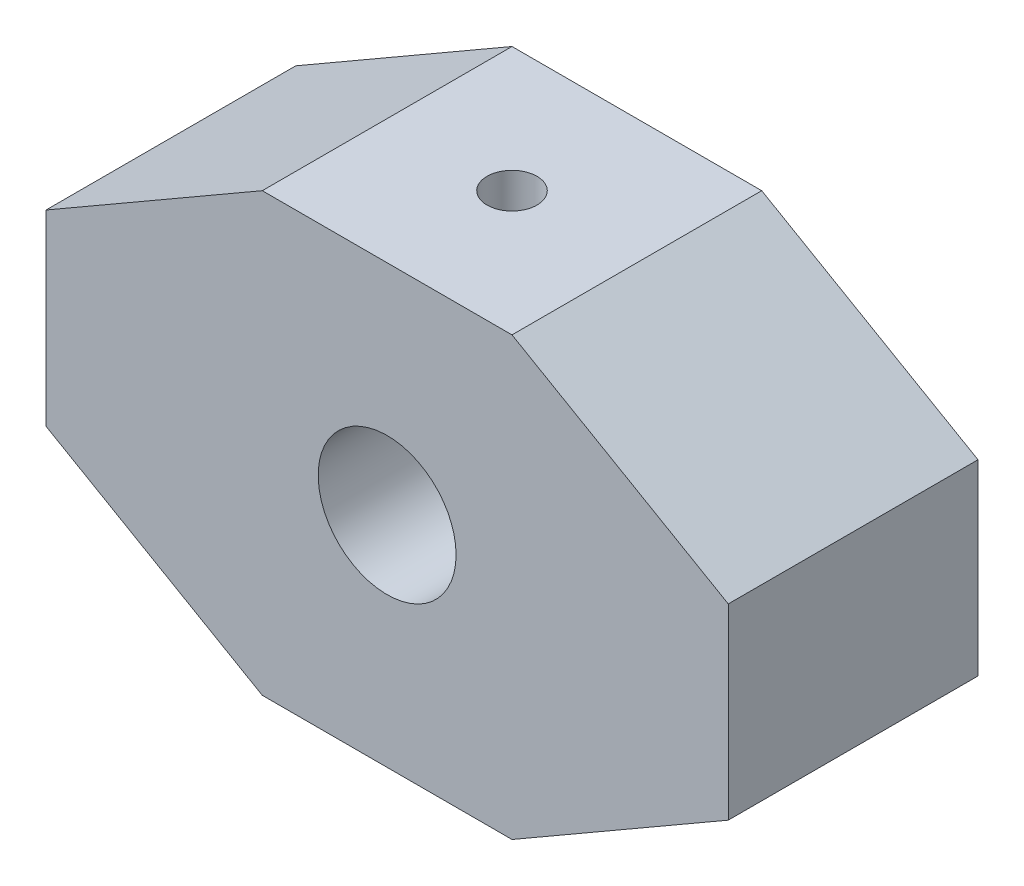
ISO-10303-21;
HEADER;
FILE_DESCRIPTION(('STEP AP214'),'2;1');
FILE_NAME('part.step','',(''),(''),'','','');
FILE_SCHEMA(('AUTOMOTIVE_DESIGN { 1 0 10303 214 1 1 1 1 }'));
ENDSEC;
DATA;
#1=APPLICATION_CONTEXT('core data for automotive mechanical design processes');
#2=APPLICATION_PROTOCOL_DEFINITION('international standard','automotive_design',2000,#1);
#3=PRODUCT_CONTEXT('',#1,'mechanical');
#4=PRODUCT('Part','Part','',(#3));
#5=PRODUCT_RELATED_PRODUCT_CATEGORY('part','',(#4));
#6=PRODUCT_DEFINITION_FORMATION('','',#4);
#7=PRODUCT_DEFINITION_CONTEXT('part definition',#1,'design');
#8=PRODUCT_DEFINITION('design','',#6,#7);
#9=PRODUCT_DEFINITION_SHAPE('','',#8);
#10=(LENGTH_UNIT() NAMED_UNIT(*) SI_UNIT(.MILLI.,.METRE.));
#11=(NAMED_UNIT(*) PLANE_ANGLE_UNIT() SI_UNIT($,.RADIAN.));
#12=(NAMED_UNIT(*) SI_UNIT($,.STERADIAN.) SOLID_ANGLE_UNIT());
#13=UNCERTAINTY_MEASURE_WITH_UNIT(LENGTH_MEASURE(1.E-05),#10,'distance_accuracy_value','');
#14=(GEOMETRIC_REPRESENTATION_CONTEXT(3) GLOBAL_UNCERTAINTY_ASSIGNED_CONTEXT((#13)) GLOBAL_UNIT_ASSIGNED_CONTEXT((#10,
#11,#12)) REPRESENTATION_CONTEXT('',''));
#15=CARTESIAN_POINT('',(0.,0.,0.));
#16=DIRECTION('',(0.,0.,1.));
#17=DIRECTION('',(1.,0.,0.));
#18=AXIS2_PLACEMENT_3D('',#15,#16,#17);
#19=CARTESIAN_POINT('',(1.6363883111979,1.79816513761468,2.));
#20=DIRECTION('',(0.,-1.,0.));
#21=DIRECTION('',(1.,0.,0.));
#22=AXIS2_PLACEMENT_3D('',#19,#20,#21);
#23=PLANE('',#22);
#24=CARTESIAN_POINT('',(0.636398311197897,1.79816513761468,0.99999));
#25=DIRECTION('',(0.,1.,0.));
#26=DIRECTION('',(-1.,0.,0.));
#27=AXIS2_PLACEMENT_3D('',#24,#25,#26);
#28=CIRCLE('',#27,0.2);
#29=CARTESIAN_POINT('',(0.436398311197897,1.79816513761468,0.99999));
#30=VERTEX_POINT('',#29);
#31=EDGE_CURVE('E188',#30,#30,#28,.T.);
#32=ORIENTED_EDGE('',*,*,#31,.F.);
#33=EDGE_LOOP('',(#32));
#34=FACE_BOUND('',#33,.T.);
#35=DIRECTION('',(-1.,0.,0.));
#36=VECTOR('',#35,1.);
#37=CARTESIAN_POINT('',(1.6363883111979,1.79816513761468,0.));
#38=LINE('',#37,#36);
#39=CARTESIAN_POINT('',(1.6363883111979,1.79816513761468,0.));
#40=VERTEX_POINT('',#39);
#41=CARTESIAN_POINT('',(-0.363611688802103,1.79816513761468,0.));
#42=VERTEX_POINT('',#41);
#43=EDGE_CURVE('E134',#40,#42,#38,.T.);
#44=ORIENTED_EDGE('',*,*,#43,.T.);
#45=DIRECTION('',(0.,0.,-1.));
#46=VECTOR('',#45,1.);
#47=CARTESIAN_POINT('',(-0.363611688802103,1.79816513761468,2.));
#48=LINE('',#47,#46);
#49=CARTESIAN_POINT('',(-0.363611688802103,1.79816513761468,2.));
#50=VERTEX_POINT('',#49);
#51=EDGE_CURVE('E11',#50,#42,#48,.T.);
#52=ORIENTED_EDGE('',*,*,#51,.F.);
#53=DIRECTION('',(-1.,0.,0.));
#54=VECTOR('',#53,1.);
#55=CARTESIAN_POINT('',(1.6363883111979,1.79816513761468,2.));
#56=LINE('',#55,#54);
#57=CARTESIAN_POINT('',(1.6363883111979,1.79816513761468,2.));
#58=VERTEX_POINT('',#57);
#59=EDGE_CURVE('E149',#58,#50,#56,.T.);
#60=ORIENTED_EDGE('',*,*,#59,.F.);
#61=DIRECTION('',(0.,0.,-1.));
#62=VECTOR('',#61,1.);
#63=CARTESIAN_POINT('',(1.6363883111979,1.79816513761468,2.));
#64=LINE('',#63,#62);
#65=EDGE_CURVE('E130',#58,#40,#64,.T.);
#66=ORIENTED_EDGE('',*,*,#65,.T.);
#67=EDGE_LOOP('',(#44,#52,#60,#66));
#68=FACE_BOUND('',#67,.T.);
#69=ADVANCED_FACE('F33',(#34,#68),#23,.F.);
#70=CARTESIAN_POINT('',(-0.363611688802103,1.79816513761468,2.));
#71=DIRECTION('',(0.5,-0.866025403784438,0.));
#72=DIRECTION('',(0.866025403784439,0.5,0.));
#73=AXIS2_PLACEMENT_3D('',#70,#71,#72);
#74=PLANE('',#73);
#75=DIRECTION('',(-0.866025403784438,-0.5,0.));
#76=VECTOR('',#75,1.);
#77=CARTESIAN_POINT('',(-0.363611688802103,1.79816513761468,0.));
#78=LINE('',#77,#76);
#79=CARTESIAN_POINT('',(-2.09566249637098,0.798165137614678,0.));
#80=VERTEX_POINT('',#79);
#81=EDGE_CURVE('E137',#42,#80,#78,.T.);
#82=ORIENTED_EDGE('',*,*,#81,.T.);
#83=DIRECTION('',(0.,0.,-1.));
#84=VECTOR('',#83,1.);
#85=CARTESIAN_POINT('',(-2.09566249637098,0.798165137614678,2.));
#86=LINE('',#85,#84);
#87=CARTESIAN_POINT('',(-2.09566249637098,0.798165137614678,2.));
#88=VERTEX_POINT('',#87);
#89=EDGE_CURVE('E46',#88,#80,#86,.T.);
#90=ORIENTED_EDGE('',*,*,#89,.F.);
#91=DIRECTION('',(-0.866025403784438,-0.5,0.));
#92=VECTOR('',#91,1.);
#93=CARTESIAN_POINT('',(-0.363611688802103,1.79816513761468,2.));
#94=LINE('',#93,#92);
#95=EDGE_CURVE('E97',#50,#88,#94,.T.);
#96=ORIENTED_EDGE('',*,*,#95,.F.);
#97=ORIENTED_EDGE('',*,*,#51,.T.);
#98=EDGE_LOOP('',(#82,#90,#96,#97));
#99=FACE_BOUND('',#98,.T.);
#100=ADVANCED_FACE('F205',(#99),#74,.F.);
#101=CARTESIAN_POINT('',(-2.09566249637098,0.798165137614678,2.));
#102=DIRECTION('',(1.,0.,0.));
#103=DIRECTION('',(0.,0.,-1.));
#104=AXIS2_PLACEMENT_3D('',#101,#102,#103);
#105=PLANE('',#104);
#106=DIRECTION('',(0.,-1.,0.));
#107=VECTOR('',#106,1.);
#108=CARTESIAN_POINT('',(-2.09566249637098,0.798165137614678,0.));
#109=LINE('',#108,#107);
#110=CARTESIAN_POINT('',(-2.09566249637098,-0.701834862385322,0.));
#111=VERTEX_POINT('',#110);
#112=EDGE_CURVE('E140',#80,#111,#109,.T.);
#113=ORIENTED_EDGE('',*,*,#112,.T.);
#114=DIRECTION('',(0.,0.,-1.));
#115=VECTOR('',#114,1.);
#116=CARTESIAN_POINT('',(-2.09566249637098,-0.701834862385322,2.));
#117=LINE('',#116,#115);
#118=CARTESIAN_POINT('',(-2.09566249637098,-0.701834862385322,2.));
#119=VERTEX_POINT('',#118);
#120=EDGE_CURVE('E156',#119,#111,#117,.T.);
#121=ORIENTED_EDGE('',*,*,#120,.F.);
#122=DIRECTION('',(0.,-1.,0.));
#123=VECTOR('',#122,1.);
#124=CARTESIAN_POINT('',(-2.09566249637098,0.798165137614678,2.));
#125=LINE('',#124,#123);
#126=EDGE_CURVE('E165',#88,#119,#125,.T.);
#127=ORIENTED_EDGE('',*,*,#126,.F.);
#128=ORIENTED_EDGE('',*,*,#89,.T.);
#129=EDGE_LOOP('',(#113,#121,#127,#128));
#130=FACE_BOUND('',#129,.T.);
#131=ADVANCED_FACE('F163',(#130),#105,.F.);
#132=CARTESIAN_POINT('',(-2.09566249637098,-0.701834862385322,2.));
#133=DIRECTION('',(0.5,0.866025403784439,0.));
#134=DIRECTION('',(-0.866025403784439,0.5,0.));
#135=AXIS2_PLACEMENT_3D('',#132,#133,#134);
#136=PLANE('',#135);
#137=DIRECTION('',(0.866025403784439,-0.5,0.));
#138=VECTOR('',#137,1.);
#139=CARTESIAN_POINT('',(-2.09566249637098,-0.701834862385322,0.));
#140=LINE('',#139,#138);
#141=CARTESIAN_POINT('',(-0.363611688802103,-1.70183486238532,0.));
#142=VERTEX_POINT('',#141);
#143=EDGE_CURVE('E142',#111,#142,#140,.T.);
#144=ORIENTED_EDGE('',*,*,#143,.T.);
#145=DIRECTION('',(0.,0.,-1.));
#146=VECTOR('',#145,1.);
#147=CARTESIAN_POINT('',(-0.363611688802103,-1.70183486238532,2.));
#148=LINE('',#147,#146);
#149=CARTESIAN_POINT('',(-0.363611688802103,-1.70183486238532,2.));
#150=VERTEX_POINT('',#149);
#151=EDGE_CURVE('E153',#150,#142,#148,.T.);
#152=ORIENTED_EDGE('',*,*,#151,.F.);
#153=DIRECTION('',(0.866025403784439,-0.5,0.));
#154=VECTOR('',#153,1.);
#155=CARTESIAN_POINT('',(-2.09566249637098,-0.701834862385322,2.));
#156=LINE('',#155,#154);
#157=EDGE_CURVE('E177',#119,#150,#156,.T.);
#158=ORIENTED_EDGE('',*,*,#157,.F.);
#159=ORIENTED_EDGE('',*,*,#120,.T.);
#160=EDGE_LOOP('',(#144,#152,#158,#159));
#161=FACE_BOUND('',#160,.T.);
#162=ADVANCED_FACE('F173',(#161),#136,.F.);
#163=CARTESIAN_POINT('',(-0.363611688802103,-1.70183486238532,2.));
#164=DIRECTION('',(0.,1.,0.));
#165=DIRECTION('',(-1.,0.,0.));
#166=AXIS2_PLACEMENT_3D('',#163,#164,#165);
#167=PLANE('',#166);
#168=DIRECTION('',(1.,0.,0.));
#169=VECTOR('',#168,1.);
#170=CARTESIAN_POINT('',(-0.363611688802103,-1.70183486238532,0.));
#171=LINE('',#170,#169);
#172=CARTESIAN_POINT('',(1.6363883111979,-1.70183486238532,0.));
#173=VERTEX_POINT('',#172);
#174=EDGE_CURVE('E144',#142,#173,#171,.T.);
#175=ORIENTED_EDGE('',*,*,#174,.T.);
#176=DIRECTION('',(0.,0.,-1.));
#177=VECTOR('',#176,1.);
#178=CARTESIAN_POINT('',(1.6363883111979,-1.70183486238532,2.));
#179=LINE('',#178,#177);
#180=CARTESIAN_POINT('',(1.6363883111979,-1.70183486238532,2.));
#181=VERTEX_POINT('',#180);
#182=EDGE_CURVE('E125',#181,#173,#179,.T.);
#183=ORIENTED_EDGE('',*,*,#182,.F.);
#184=DIRECTION('',(1.,0.,0.));
#185=VECTOR('',#184,1.);
#186=CARTESIAN_POINT('',(-0.363611688802103,-1.70183486238532,2.));
#187=LINE('',#186,#185);
#188=EDGE_CURVE('E116',#150,#181,#187,.T.);
#189=ORIENTED_EDGE('',*,*,#188,.F.);
#190=ORIENTED_EDGE('',*,*,#151,.T.);
#191=EDGE_LOOP('',(#175,#183,#189,#190));
#192=FACE_BOUND('',#191,.T.);
#193=ADVANCED_FACE('F176',(#192),#167,.F.);
#194=CARTESIAN_POINT('',(1.6363883111979,-1.70183486238532,2.));
#195=DIRECTION('',(-0.5,0.866025403784439,0.));
#196=DIRECTION('',(-0.866025403784439,-0.5,0.));
#197=AXIS2_PLACEMENT_3D('',#194,#195,#196);
#198=PLANE('',#197);
#199=DIRECTION('',(0.866025403784439,0.5,0.));
#200=VECTOR('',#199,1.);
#201=CARTESIAN_POINT('',(1.6363883111979,-1.70183486238532,0.));
#202=LINE('',#201,#200);
#203=CARTESIAN_POINT('',(3.36843911876677,-0.701834862385322,0.));
#204=VERTEX_POINT('',#203);
#205=EDGE_CURVE('E124',#173,#204,#202,.T.);
#206=ORIENTED_EDGE('',*,*,#205,.T.);
#207=DIRECTION('',(0.,0.,-1.));
#208=VECTOR('',#207,1.);
#209=CARTESIAN_POINT('',(3.36843911876677,-0.701834862385322,2.));
#210=LINE('',#209,#208);
#211=CARTESIAN_POINT('',(3.36843911876677,-0.701834862385322,2.));
#212=VERTEX_POINT('',#211);
#213=EDGE_CURVE('E121',#212,#204,#210,.T.);
#214=ORIENTED_EDGE('',*,*,#213,.F.);
#215=DIRECTION('',(0.866025403784439,0.5,0.));
#216=VECTOR('',#215,1.);
#217=CARTESIAN_POINT('',(1.6363883111979,-1.70183486238532,2.));
#218=LINE('',#217,#216);
#219=EDGE_CURVE('E110',#181,#212,#218,.T.);
#220=ORIENTED_EDGE('',*,*,#219,.F.);
#221=ORIENTED_EDGE('',*,*,#182,.T.);
#222=EDGE_LOOP('',(#206,#214,#220,#221));
#223=FACE_BOUND('',#222,.T.);
#224=ADVANCED_FACE('F122',(#223),#198,.F.);
#225=CARTESIAN_POINT('',(3.36843911876677,-0.701834862385322,2.));
#226=DIRECTION('',(-1.,0.,0.));
#227=DIRECTION('',(0.,0.,1.));
#228=AXIS2_PLACEMENT_3D('',#225,#226,#227);
#229=PLANE('',#228);
#230=DIRECTION('',(0.,1.,0.));
#231=VECTOR('',#230,1.);
#232=CARTESIAN_POINT('',(3.36843911876677,-0.701834862385322,0.));
#233=LINE('',#232,#231);
#234=CARTESIAN_POINT('',(3.36843911876677,0.798165137614678,0.));
#235=VERTEX_POINT('',#234);
#236=EDGE_CURVE('E83',#204,#235,#233,.T.);
#237=ORIENTED_EDGE('',*,*,#236,.T.);
#238=DIRECTION('',(0.,0.,-1.));
#239=VECTOR('',#238,1.);
#240=CARTESIAN_POINT('',(3.36843911876677,0.798165137614678,2.));
#241=LINE('',#240,#239);
#242=CARTESIAN_POINT('',(3.36843911876677,0.798165137614678,2.));
#243=VERTEX_POINT('',#242);
#244=EDGE_CURVE('E126',#243,#235,#241,.T.);
#245=ORIENTED_EDGE('',*,*,#244,.F.);
#246=DIRECTION('',(0.,1.,0.));
#247=VECTOR('',#246,1.);
#248=CARTESIAN_POINT('',(3.36843911876677,-0.701834862385322,2.));
#249=LINE('',#248,#247);
#250=EDGE_CURVE('E114',#212,#243,#249,.T.);
#251=ORIENTED_EDGE('',*,*,#250,.F.);
#252=ORIENTED_EDGE('',*,*,#213,.T.);
#253=EDGE_LOOP('',(#237,#245,#251,#252));
#254=FACE_BOUND('',#253,.T.);
#255=ADVANCED_FACE('F128',(#254),#229,.F.);
#256=CARTESIAN_POINT('',(3.36843911876677,0.798165137614678,2.));
#257=DIRECTION('',(-0.5,-0.866025403784438,0.));
#258=DIRECTION('',(0.866025403784438,-0.5,0.));
#259=AXIS2_PLACEMENT_3D('',#256,#257,#258);
#260=PLANE('',#259);
#261=DIRECTION('',(-0.866025403784438,0.5,0.));
#262=VECTOR('',#261,1.);
#263=CARTESIAN_POINT('',(3.36843911876677,0.798165137614678,0.));
#264=LINE('',#263,#262);
#265=EDGE_CURVE('E89',#235,#40,#264,.T.);
#266=ORIENTED_EDGE('',*,*,#265,.T.);
#267=ORIENTED_EDGE('',*,*,#65,.F.);
#268=DIRECTION('',(-0.866025403784438,0.5,0.));
#269=VECTOR('',#268,1.);
#270=CARTESIAN_POINT('',(3.36843911876677,0.798165137614678,2.));
#271=LINE('',#270,#269);
#272=EDGE_CURVE('E54',#243,#58,#271,.T.);
#273=ORIENTED_EDGE('',*,*,#272,.F.);
#274=ORIENTED_EDGE('',*,*,#244,.T.);
#275=EDGE_LOOP('',(#266,#267,#273,#274));
#276=FACE_BOUND('',#275,.T.);
#277=ADVANCED_FACE('F213',(#276),#260,.F.);
#278=CARTESIAN_POINT('',(0.,0.,2.));
#279=DIRECTION('',(0.,0.,1.));
#280=DIRECTION('',(1.,0.,0.));
#281=AXIS2_PLACEMENT_3D('',#278,#279,#280);
#282=PLANE('',#281);
#283=CARTESIAN_POINT('',(0.636338311197897,0.0481551376146783,2.));
#284=DIRECTION('',(0.,0.,1.));
#285=DIRECTION('',(1.,0.,0.));
#286=AXIS2_PLACEMENT_3D('',#283,#284,#285);
#287=CIRCLE('',#286,0.552184805776982);
#288=CARTESIAN_POINT('',(1.18852311697488,0.0481551376146783,2.));
#289=VERTEX_POINT('',#288);
#290=EDGE_CURVE('E183',#289,#289,#287,.T.);
#291=ORIENTED_EDGE('',*,*,#290,.F.);
#292=EDGE_LOOP('',(#291));
#293=FACE_BOUND('',#292,.T.);
#294=ORIENTED_EDGE('',*,*,#59,.T.);
#295=ORIENTED_EDGE('',*,*,#95,.T.);
#296=ORIENTED_EDGE('',*,*,#126,.T.);
#297=ORIENTED_EDGE('',*,*,#157,.T.);
#298=ORIENTED_EDGE('',*,*,#188,.T.);
#299=ORIENTED_EDGE('',*,*,#219,.T.);
#300=ORIENTED_EDGE('',*,*,#250,.T.);
#301=ORIENTED_EDGE('',*,*,#272,.T.);
#302=EDGE_LOOP('',(#294,#295,#296,#297,#298,#299,#300,#301));
#303=FACE_BOUND('',#302,.T.);
#304=ADVANCED_FACE('F112',(#293,#303),#282,.T.);
#305=CARTESIAN_POINT('',(0.,0.,0.));
#306=DIRECTION('',(0.,0.,1.));
#307=DIRECTION('',(1.,0.,0.));
#308=AXIS2_PLACEMENT_3D('',#305,#306,#307);
#309=PLANE('',#308);
#310=CARTESIAN_POINT('',(0.636338311197897,0.0481551376146783,0.));
#311=DIRECTION('',(0.,0.,1.));
#312=DIRECTION('',(1.,0.,0.));
#313=AXIS2_PLACEMENT_3D('',#310,#311,#312);
#314=CIRCLE('',#313,0.552184805776982);
#315=CARTESIAN_POINT('',(1.18852311697488,0.0481551376146783,0.));
#316=VERTEX_POINT('',#315);
#317=EDGE_CURVE('E138',#316,#316,#314,.T.);
#318=ORIENTED_EDGE('',*,*,#317,.T.);
#319=EDGE_LOOP('',(#318));
#320=FACE_BOUND('',#319,.T.);
#321=ORIENTED_EDGE('',*,*,#43,.F.);
#322=ORIENTED_EDGE('',*,*,#265,.F.);
#323=ORIENTED_EDGE('',*,*,#236,.F.);
#324=ORIENTED_EDGE('',*,*,#205,.F.);
#325=ORIENTED_EDGE('',*,*,#174,.F.);
#326=ORIENTED_EDGE('',*,*,#143,.F.);
#327=ORIENTED_EDGE('',*,*,#112,.F.);
#328=ORIENTED_EDGE('',*,*,#81,.F.);
#329=EDGE_LOOP('',(#321,#322,#323,#324,#325,#326,#327,#328));
#330=FACE_BOUND('',#329,.T.);
#331=ADVANCED_FACE('F169',(#320,#330),#309,.F.);
#332=CARTESIAN_POINT('',(0.636338311197897,0.0481551376146783,0.));
#333=DIRECTION('',(0.,0.,1.));
#334=DIRECTION('',(1.,0.,0.));
#335=AXIS2_PLACEMENT_3D('',#332,#333,#334);
#336=CYLINDRICAL_SURFACE('',#335,0.552184805776982);
#337=CARTESIAN_POINT('',(0.436398311197898,0.562870647514044,0.99999));
#338=CARTESIAN_POINT('',(0.43639803160383,0.562870397633737,1.01082103067226));
#339=CARTESIAN_POINT('',(0.437281088538378,0.563216137775308,1.02165014905069));
#340=CARTESIAN_POINT('',(0.440775261670415,0.564552852231902,1.04298367926231));
#341=CARTESIAN_POINT('',(0.443386422838341,0.565543843338274,1.053488082638));
#342=CARTESIAN_POINT('',(0.450229912660806,0.568044378504378,1.07385875085924));
#343=CARTESIAN_POINT('',(0.454458590189627,0.569552753916357,1.08372639482034));
#344=CARTESIAN_POINT('',(0.464404279692249,0.572916241314307,1.1026158837424));
#345=CARTESIAN_POINT('',(0.47012170462632,0.574771449467091,1.11163749307781));
#346=CARTESIAN_POINT('',(0.483166025720824,0.578715747795546,1.12899633987778));
#347=CARTESIAN_POINT('',(0.490550506203018,0.580811393403973,1.13728882749566));
#348=CARTESIAN_POINT('',(0.50659692219224,0.584945421933888,1.15254893392824));
#349=CARTESIAN_POINT('',(0.515259106462122,0.586983793612203,1.15951629414081));
#350=CARTESIAN_POINT('',(0.533950536435925,0.590850788215852,1.17213972241779));
#351=CARTESIAN_POINT('',(0.5440141697608,0.592670814268222,1.17774774114498));
#352=CARTESIAN_POINT('',(0.565019476476331,0.595817658624116,1.18717292213246));
#353=CARTESIAN_POINT('',(0.575960865861515,0.597144635681513,1.19099066093812));
#354=CARTESIAN_POINT('',(0.59794069912492,0.599109245557333,1.19657157232939));
#355=CARTESIAN_POINT('',(0.608957254308705,0.59977262697241,1.19841171298525));
#356=CARTESIAN_POINT('',(0.631161429941262,0.600427234979468,1.20023124291933));
#357=CARTESIAN_POINT('',(0.642348997485398,0.600418665401881,1.20021119646862));
#358=CARTESIAN_POINT('',(0.664028589383873,0.599747004044318,1.19835703163791));
#359=CARTESIAN_POINT('',(0.67452887734521,0.599114152602403,1.19660671939617));
#360=CARTESIAN_POINT('',(0.695075089775896,0.597303994059605,1.19148194839157));
#361=CARTESIAN_POINT('',(0.705120982252237,0.596126648687381,1.18810737546214));
#362=CARTESIAN_POINT('',(0.724642271333405,0.593324080118486,1.17978769655736));
#363=CARTESIAN_POINT('',(0.734107524953093,0.591692726569994,1.17482094139856));
#364=CARTESIAN_POINT('',(0.752093064566657,0.588148699329678,1.1634765823343));
#365=CARTESIAN_POINT('',(0.76061305626758,0.586235938454674,1.1570985408866));
#366=CARTESIAN_POINT('',(0.776962204414006,0.582203600583747,1.14270242194799));
#367=CARTESIAN_POINT('',(0.784727688188417,0.580078434597361,1.13461349156703));
#368=CARTESIAN_POINT('',(0.798814841090741,0.575946248821132,1.11723349985292));
#369=CARTESIAN_POINT('',(0.80513619606815,0.573939254808337,1.10794217764312));
#370=CARTESIAN_POINT('',(0.816266061625582,0.570236798139895,1.08818612374287));
#371=CARTESIAN_POINT('',(0.821042724881639,0.568548160913121,1.07770206980661));
#372=CARTESIAN_POINT('',(0.828739404529192,0.565752324194084,1.05600125523389));
#373=CARTESIAN_POINT('',(0.831660371957441,0.564644826920632,1.04478487316838));
#374=CARTESIAN_POINT('',(0.83542273737055,0.563205932498194,1.02256372561158));
#375=CARTESIAN_POINT('',(0.836364600268619,0.562837088851669,1.01157840667187));
#376=CARTESIAN_POINT('',(0.836430218286289,0.562811648488506,0.989602883336498));
#377=CARTESIAN_POINT('',(0.8355543854402,0.563154890356693,0.978612680612483));
#378=CARTESIAN_POINT('',(0.832100310353276,0.564477148776151,0.957435193539794));
#379=CARTESIAN_POINT('',(0.829597101159658,0.565428113761164,0.947233721542919));
#380=CARTESIAN_POINT('',(0.823052322048819,0.567826185833613,0.927399360919671));
#381=CARTESIAN_POINT('',(0.819010449862704,0.569273390401299,0.917766584442759));
#382=CARTESIAN_POINT('',(0.809339707479554,0.57256478989263,0.898959974479871));
#383=CARTESIAN_POINT('',(0.803659201601346,0.574421342587179,0.889814918123966));
#384=CARTESIAN_POINT('',(0.790928499554734,0.578300545721978,0.872571938706354));
#385=CARTESIAN_POINT('',(0.783877831697599,0.580323253223458,0.864474377856602));
#386=CARTESIAN_POINT('',(0.768118728858678,0.584449848041056,0.849065784534241));
#387=CARTESIAN_POINT('',(0.759337482299341,0.586551569373919,0.841828395427893));
#388=CARTESIAN_POINT('',(0.740633325671373,0.590485124581841,0.828922369220775));
#389=CARTESIAN_POINT('',(0.730710428600223,0.592316961528943,0.823253714262758));
#390=CARTESIAN_POINT('',(0.710026947436301,0.595500448636893,0.813689226091716));
#391=CARTESIAN_POINT('',(0.699270503093122,0.596854306964865,0.809785216461813));
#392=CARTESIAN_POINT('',(0.677193830030716,0.598937823622093,0.803862017819733));
#393=CARTESIAN_POINT('',(0.665873848659931,0.599667753294833,0.801842009429878));
#394=CARTESIAN_POINT('',(0.643659180560078,0.600397125243326,0.79982803003658));
#395=CARTESIAN_POINT('',(0.632775155501336,0.600434385036964,0.799729157119577));
#396=CARTESIAN_POINT('',(0.611152485376294,0.599871241176807,0.801293975647122));
#397=CARTESIAN_POINT('',(0.600413824814031,0.599270906041952,0.802957477698544));
#398=CARTESIAN_POINT('',(0.579620495659347,0.597516396759116,0.807927152805013));
#399=CARTESIAN_POINT('',(0.569556073979303,0.59637443695746,0.811197152823667));
#400=CARTESIAN_POINT('',(0.55011679572766,0.593655222134651,0.819251906137137));
#401=CARTESIAN_POINT('',(0.540742069244779,0.592077885258923,0.824036944296852));
#402=CARTESIAN_POINT('',(0.522531847012923,0.588567617897261,0.835207942753911));
#403=CARTESIAN_POINT('',(0.513733719486245,0.586622846389068,0.841651034024834));
#404=CARTESIAN_POINT('',(0.497310463532249,0.582618323949298,0.855863000067154));
#405=CARTESIAN_POINT('',(0.489685742903174,0.580558533382152,0.863632333782606));
#406=CARTESIAN_POINT('',(0.475447445928363,0.576435203292931,0.880723953289264));
#407=CARTESIAN_POINT('',(0.468900634414704,0.574376303487873,0.890103185381267));
#408=CARTESIAN_POINT('',(0.457475943675459,0.570603852223989,0.909893933089621));
#409=CARTESIAN_POINT('',(0.452598029125223,0.568890293455829,0.920305426850624));
#410=CARTESIAN_POINT('',(0.444620539691108,0.566007242718669,0.942047710944009));
#411=CARTESIAN_POINT('',(0.441549088985644,0.564846406075648,0.953390058603566));
#412=CARTESIAN_POINT('',(0.437438677520289,0.563278448392325,0.9764858387883));
#413=CARTESIAN_POINT('',(0.436398614539052,0.562870918617724,0.988239044857592));
#414=CARTESIAN_POINT('',(0.436398311197898,0.562870647514044,0.99999));
#415=B_SPLINE_CURVE_WITH_KNOTS('',3,(#337,#338,#339,#340,#341,#342,#343,#344,#345,#346,#347,
#348,#349,#350,#351,#352,#353,#354,#355,#356,#357,#358,#359,#360,#361,#362,#363,#364,#365,#366,
#367,#368,#369,#370,#371,#372,#373,#374,#375,#376,#377,#378,#379,#380,#381,#382,#383,#384,#385,
#386,#387,#388,#389,#390,#391,#392,#393,#394,#395,#396,#397,#398,#399,#400,#401,#402,#403,#404,
#405,#406,#407,#408,#409,#410,#411,#412,#413,#414),.UNSPECIFIED.,.T.,.F.,(4,2,2,2,2,2,2,2,2,2,2,
2,2,2,2,2,2,2,2,2,2,2,2,2,2,2,2,2,2,2,2,2,2,2,2,2,2,2,4),(0.,0.0324494119980878,
0.0648996684600502,0.0972771050106779,0.129663532250323,0.163412257056189,0.197167561272553,
0.231982882896114,0.266786984809853,0.300181118082422,0.33356512157715,0.365407643983272,
0.397252404873992,0.429549967394019,0.461857557218877,0.495940153997934,0.530030157935595,
0.56478381553815,0.599519647630175,0.632444802654266,0.665362495036823,0.696860837844357,
0.728365371667488,0.760997801244848,0.793641484750376,0.828193309377305,0.86274474067702,
0.897134395570341,0.931509086952641,0.964001164636751,0.996489750923102,1.02827819032803,
1.06007261030416,1.09315843449871,1.12625573128581,1.16095425758757,1.19565204939871,
1.23087664289451,1.26608211837743),.UNSPECIFIED.);
#416=CARTESIAN_POINT('',(0.436398311197898,0.562870647514044,0.99999));
#417=VERTEX_POINT('',#416);
#418=EDGE_CURVE('E36',#417,#417,#415,.T.);
#419=ORIENTED_EDGE('',*,*,#418,.T.);
#420=EDGE_LOOP('',(#419));
#421=FACE_BOUND('',#420,.T.);
#422=ORIENTED_EDGE('',*,*,#317,.F.);
#423=EDGE_LOOP('',(#422));
#424=FACE_BOUND('',#423,.T.);
#425=ORIENTED_EDGE('',*,*,#290,.T.);
#426=EDGE_LOOP('',(#425));
#427=FACE_BOUND('',#426,.T.);
#428=ADVANCED_FACE('F195',(#421,#424,#427),#336,.F.);
#429=CARTESIAN_POINT('',(0.636398311197898,-0.201834862385321,0.99999));
#430=DIRECTION('',(0.,1.,0.));
#431=DIRECTION('',(-1.,0.,0.));
#432=AXIS2_PLACEMENT_3D('',#429,#430,#431);
#433=CYLINDRICAL_SURFACE('',#432,0.2);
#434=ORIENTED_EDGE('',*,*,#31,.T.);
#435=EDGE_LOOP('',(#434));
#436=FACE_BOUND('',#435,.T.);
#437=ORIENTED_EDGE('',*,*,#418,.F.);
#438=EDGE_LOOP('',(#437));
#439=FACE_BOUND('',#438,.T.);
#440=ADVANCED_FACE('F198',(#436,#439),#433,.F.);
#441=CLOSED_SHELL('',(#69,#100,#131,#162,#193,#224,#255,#277,#304,#331,#428,#440));
#442=MANIFOLD_SOLID_BREP('B2',#441);
#443=ADVANCED_BREP_SHAPE_REPRESENTATION('',(#18,#442),#14);
#444=SHAPE_DEFINITION_REPRESENTATION(#9,#443);
ENDSEC;
END-ISO-10303-21;
